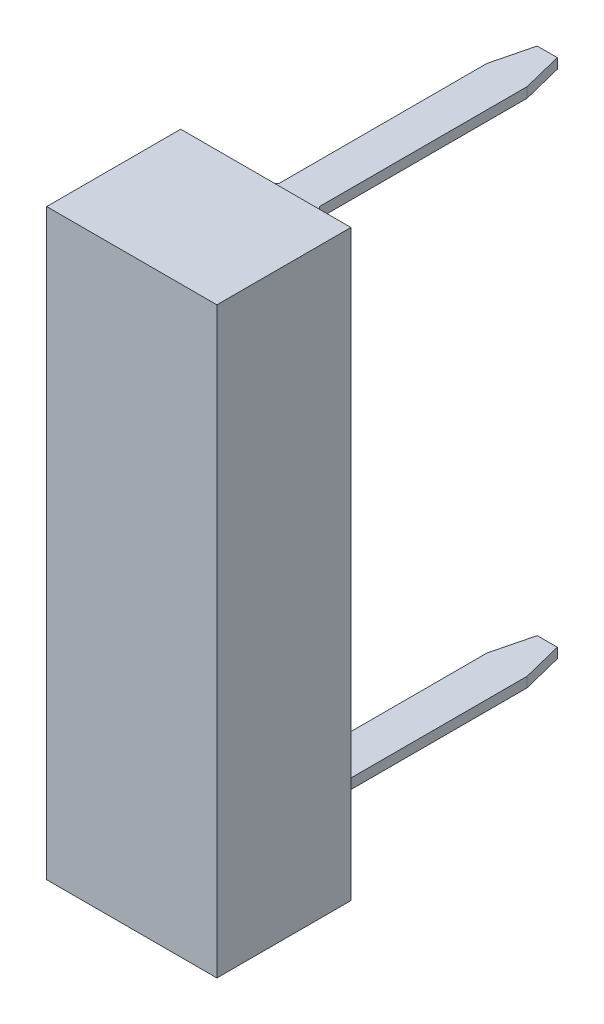
ISO-10303-21;
HEADER;
FILE_DESCRIPTION(('STEP AP214'),'2;1');
FILE_NAME('part.step','',(''),(''),'','','');
FILE_SCHEMA(('AUTOMOTIVE_DESIGN { 1 0 10303 214 1 1 1 1 }'));
ENDSEC;
DATA;
#1=APPLICATION_CONTEXT('core data for automotive mechanical design processes');
#2=APPLICATION_PROTOCOL_DEFINITION('international standard','automotive_design',2000,#1);
#3=PRODUCT_CONTEXT('',#1,'mechanical');
#4=PRODUCT('Part','Part','',(#3));
#5=PRODUCT_RELATED_PRODUCT_CATEGORY('part','',(#4));
#6=PRODUCT_DEFINITION_FORMATION('','',#4);
#7=PRODUCT_DEFINITION_CONTEXT('part definition',#1,'design');
#8=PRODUCT_DEFINITION('design','',#6,#7);
#9=PRODUCT_DEFINITION_SHAPE('','',#8);
#10=(LENGTH_UNIT() NAMED_UNIT(*) SI_UNIT(.MILLI.,.METRE.));
#11=(NAMED_UNIT(*) PLANE_ANGLE_UNIT() SI_UNIT($,.RADIAN.));
#12=(NAMED_UNIT(*) SI_UNIT($,.STERADIAN.) SOLID_ANGLE_UNIT());
#13=UNCERTAINTY_MEASURE_WITH_UNIT(LENGTH_MEASURE(1.E-05),#10,'distance_accuracy_value','');
#14=(GEOMETRIC_REPRESENTATION_CONTEXT(3) GLOBAL_UNCERTAINTY_ASSIGNED_CONTEXT((#13)) GLOBAL_UNIT_ASSIGNED_CONTEXT((#10,
#11,#12)) REPRESENTATION_CONTEXT('',''));
#15=CARTESIAN_POINT('',(0.,0.,0.));
#16=DIRECTION('',(0.,0.,1.));
#17=DIRECTION('',(1.,0.,0.));
#18=AXIS2_PLACEMENT_3D('',#15,#16,#17);
#19=CARTESIAN_POINT('',(0.6,3.885,-4.2));
#20=DIRECTION('',(0.,1.,0.));
#21=DIRECTION('',(-1.,0.,0.));
#22=AXIS2_PLACEMENT_3D('',#19,#20,#21);
#23=PLANE('',#22);
#24=DIRECTION('',(0.,0.,-1.));
#25=VECTOR('',#24,1.);
#26=CARTESIAN_POINT('',(0.3,3.885,-4.2));
#27=LINE('',#26,#25);
#28=CARTESIAN_POINT('',(0.3,3.885,-3.6));
#29=VERTEX_POINT('',#28);
#30=CARTESIAN_POINT('',(0.299999999999995,3.885,-0.499999999999995));
#31=VERTEX_POINT('',#30);
#32=EDGE_CURVE('E219',#29,#31,#27,.F.);
#33=ORIENTED_EDGE('',*,*,#32,.F.);
#34=DIRECTION('',(-0.242535625036098,0.,-0.970142500145391));
#35=VECTOR('',#34,1.);
#36=CARTESIAN_POINT('',(0.3,3.885,-3.6));
#37=LINE('',#36,#35);
#38=CARTESIAN_POINT('',(0.150000000000036,3.885,-4.20000000000001));
#39=VERTEX_POINT('',#38);
#40=EDGE_CURVE('E228',#39,#29,#37,.F.);
#41=ORIENTED_EDGE('',*,*,#40,.F.);
#42=DIRECTION('',(1.,0.,0.));
#43=VECTOR('',#42,1.);
#44=CARTESIAN_POINT('',(0.6,3.885,-4.2));
#45=LINE('',#44,#43);
#46=CARTESIAN_POINT('',(-0.150000000000036,3.885,-4.20000000000001));
#47=VERTEX_POINT('',#46);
#48=EDGE_CURVE('E235',#39,#47,#45,.F.);
#49=ORIENTED_EDGE('',*,*,#48,.T.);
#50=DIRECTION('',(-0.242535625036098,0.,0.970142500145391));
#51=VECTOR('',#50,1.);
#52=CARTESIAN_POINT('',(-0.3,3.885,-3.6));
#53=LINE('',#52,#51);
#54=CARTESIAN_POINT('',(-0.3,3.885,-3.6));
#55=VERTEX_POINT('',#54);
#56=EDGE_CURVE('E204',#55,#47,#53,.F.);
#57=ORIENTED_EDGE('',*,*,#56,.F.);
#58=DIRECTION('',(0.,0.,1.));
#59=VECTOR('',#58,1.);
#60=CARTESIAN_POINT('',(-0.3,3.885,-0.5));
#61=LINE('',#60,#59);
#62=CARTESIAN_POINT('',(-0.3,3.885,-0.5));
#63=VERTEX_POINT('',#62);
#64=EDGE_CURVE('E201',#63,#55,#61,.F.);
#65=ORIENTED_EDGE('',*,*,#64,.F.);
#66=DIRECTION('',(-0.707106781186547,0.,0.707106781186548));
#67=VECTOR('',#66,1.);
#68=CARTESIAN_POINT('',(-0.3,3.885,-0.5));
#69=LINE('',#68,#67);
#70=CARTESIAN_POINT('',(-0.6,3.885,-0.2));
#71=VERTEX_POINT('',#70);
#72=EDGE_CURVE('E20',#63,#71,#69,.T.);
#73=ORIENTED_EDGE('',*,*,#72,.T.);
#74=DIRECTION('',(0.,0.,1.));
#75=VECTOR('',#74,1.);
#76=CARTESIAN_POINT('',(-0.6,3.885,-4.2));
#77=LINE('',#76,#75);
#78=CARTESIAN_POINT('',(-0.6,3.885,0.));
#79=VERTEX_POINT('',#78);
#80=EDGE_CURVE('E182',#71,#79,#77,.T.);
#81=ORIENTED_EDGE('',*,*,#80,.T.);
#82=DIRECTION('',(-1.,0.,0.));
#83=VECTOR('',#82,1.);
#84=CARTESIAN_POINT('',(0.6,3.885,0.));
#85=LINE('',#84,#83);
#86=CARTESIAN_POINT('',(0.6,3.885,0.));
#87=VERTEX_POINT('',#86);
#88=EDGE_CURVE('E176',#79,#87,#85,.F.);
#89=ORIENTED_EDGE('',*,*,#88,.T.);
#90=DIRECTION('',(0.,0.,1.));
#91=VECTOR('',#90,1.);
#92=CARTESIAN_POINT('',(0.6,3.885,-4.2));
#93=LINE('',#92,#91);
#94=CARTESIAN_POINT('',(0.599999999999996,3.885,-0.199999999999996));
#95=VERTEX_POINT('',#94);
#96=EDGE_CURVE('E253',#87,#95,#93,.F.);
#97=ORIENTED_EDGE('',*,*,#96,.T.);
#98=DIRECTION('',(-0.707106781186547,0.,-0.707106781186548));
#99=VECTOR('',#98,1.);
#100=CARTESIAN_POINT('',(0.6,3.885,-0.2));
#101=LINE('',#100,#99);
#102=EDGE_CURVE('E251',#95,#31,#101,.T.);
#103=ORIENTED_EDGE('',*,*,#102,.T.);
#104=EDGE_LOOP('',(#33,#41,#49,#57,#65,#73,#81,#89,#97,#103));
#105=FACE_BOUND('',#104,.T.);
#106=ADVANCED_FACE('F17',(#105),#23,.T.);
#107=CARTESIAN_POINT('',(-0.6,-3.735,-4.2));
#108=DIRECTION('',(0.,-1.,0.));
#109=DIRECTION('',(0.,0.,-1.));
#110=AXIS2_PLACEMENT_3D('',#107,#108,#109);
#111=PLANE('',#110);
#112=DIRECTION('',(0.242535625036333,0.,0.970142500145332));
#113=VECTOR('',#112,1.);
#114=CARTESIAN_POINT('',(0.15,-3.735,-4.2));
#115=LINE('',#114,#113);
#116=CARTESIAN_POINT('',(0.150000000000036,-3.735,-4.20000000000001));
#117=VERTEX_POINT('',#116);
#118=CARTESIAN_POINT('',(0.3,-3.735,-3.6));
#119=VERTEX_POINT('',#118);
#120=EDGE_CURVE('E207',#117,#119,#115,.T.);
#121=ORIENTED_EDGE('',*,*,#120,.F.);
#122=DIRECTION('',(1.,0.,0.));
#123=VECTOR('',#122,1.);
#124=CARTESIAN_POINT('',(-0.6,-3.735,-4.2));
#125=LINE('',#124,#123);
#126=CARTESIAN_POINT('',(-0.150000000000036,-3.735,-4.20000000000001));
#127=VERTEX_POINT('',#126);
#128=EDGE_CURVE('E241',#127,#117,#125,.T.);
#129=ORIENTED_EDGE('',*,*,#128,.F.);
#130=DIRECTION('',(-0.242535625036098,0.,0.970142500145391));
#131=VECTOR('',#130,1.);
#132=CARTESIAN_POINT('',(-0.3,-3.735,-3.6));
#133=LINE('',#132,#131);
#134=CARTESIAN_POINT('',(-0.3,-3.735,-3.6));
#135=VERTEX_POINT('',#134);
#136=EDGE_CURVE('E213',#135,#127,#133,.F.);
#137=ORIENTED_EDGE('',*,*,#136,.F.);
#138=DIRECTION('',(0.,0.,-1.));
#139=VECTOR('',#138,1.);
#140=CARTESIAN_POINT('',(-0.3,-3.735,-0.5));
#141=LINE('',#140,#139);
#142=CARTESIAN_POINT('',(-0.299999999999993,-3.735,-0.499999999999994));
#143=VERTEX_POINT('',#142);
#144=EDGE_CURVE('E338',#135,#143,#141,.F.);
#145=ORIENTED_EDGE('',*,*,#144,.T.);
#146=DIRECTION('',(0.707106781186547,0.,-0.707106781186548));
#147=VECTOR('',#146,1.);
#148=CARTESIAN_POINT('',(-0.6,-3.735,-0.2));
#149=LINE('',#148,#147);
#150=CARTESIAN_POINT('',(-0.599999999999993,-3.735,-0.199999999999994));
#151=VERTEX_POINT('',#150);
#152=EDGE_CURVE('E243',#151,#143,#149,.T.);
#153=ORIENTED_EDGE('',*,*,#152,.F.);
#154=DIRECTION('',(0.,0.,-1.));
#155=VECTOR('',#154,1.);
#156=CARTESIAN_POINT('',(-0.6,-3.735,-4.2));
#157=LINE('',#156,#155);
#158=CARTESIAN_POINT('',(-0.6,-3.735,0.));
#159=VERTEX_POINT('',#158);
#160=EDGE_CURVE('E245',#159,#151,#157,.T.);
#161=ORIENTED_EDGE('',*,*,#160,.F.);
#162=DIRECTION('',(1.,0.,0.));
#163=VECTOR('',#162,1.);
#164=CARTESIAN_POINT('',(-0.6,-3.735,0.));
#165=LINE('',#164,#163);
#166=CARTESIAN_POINT('',(0.6,-3.735,0.));
#167=VERTEX_POINT('',#166);
#168=EDGE_CURVE('E247',#167,#159,#165,.F.);
#169=ORIENTED_EDGE('',*,*,#168,.F.);
#170=DIRECTION('',(0.,0.,-1.));
#171=VECTOR('',#170,1.);
#172=CARTESIAN_POINT('',(0.6,-3.735,-4.2));
#173=LINE('',#172,#171);
#174=CARTESIAN_POINT('',(0.6,-3.735,-0.2));
#175=VERTEX_POINT('',#174);
#176=EDGE_CURVE('E249',#175,#167,#173,.F.);
#177=ORIENTED_EDGE('',*,*,#176,.F.);
#178=DIRECTION('',(0.707106781186548,0.,0.707106781186548));
#179=VECTOR('',#178,1.);
#180=CARTESIAN_POINT('',(0.6,-3.735,-0.2));
#181=LINE('',#180,#179);
#182=CARTESIAN_POINT('',(0.3,-3.735,-0.5));
#183=VERTEX_POINT('',#182);
#184=EDGE_CURVE('E336',#175,#183,#181,.F.);
#185=ORIENTED_EDGE('',*,*,#184,.T.);
#186=DIRECTION('',(0.,0.,1.));
#187=VECTOR('',#186,1.);
#188=CARTESIAN_POINT('',(0.3,-3.735,-4.2));
#189=LINE('',#188,#187);
#190=EDGE_CURVE('E330',#183,#119,#189,.F.);
#191=ORIENTED_EDGE('',*,*,#190,.T.);
#192=EDGE_LOOP('',(#121,#129,#137,#145,#153,#161,#169,#177,#185,#191));
#193=FACE_BOUND('',#192,.T.);
#194=ADVANCED_FACE('F353',(#193),#111,.F.);
#195=CARTESIAN_POINT('',(-0.3,10.980965349185,-0.5));
#196=DIRECTION('',(-1.,0.,0.));
#197=DIRECTION('',(0.,0.,1.));
#198=AXIS2_PLACEMENT_3D('',#195,#196,#197);
#199=PLANE('',#198);
#200=DIRECTION('',(0.,0.,-1.));
#201=VECTOR('',#200,1.);
#202=CARTESIAN_POINT('',(-0.3,3.735,-4.2));
#203=LINE('',#202,#201);
#204=CARTESIAN_POINT('',(-0.3,3.735,-0.5));
#205=VERTEX_POINT('',#204);
#206=CARTESIAN_POINT('',(-0.3,3.735,-3.6));
#207=VERTEX_POINT('',#206);
#208=EDGE_CURVE('E212',#205,#207,#203,.T.);
#209=ORIENTED_EDGE('',*,*,#208,.F.);
#210=DIRECTION('',(0.,1.,0.));
#211=VECTOR('',#210,1.);
#212=CARTESIAN_POINT('',(-0.3,3.885,-0.5));
#213=LINE('',#212,#211);
#214=EDGE_CURVE('E209',#205,#63,#213,.T.);
#215=ORIENTED_EDGE('',*,*,#214,.T.);
#216=ORIENTED_EDGE('',*,*,#64,.T.);
#217=DIRECTION('',(0.,1.,0.));
#218=VECTOR('',#217,1.);
#219=CARTESIAN_POINT('',(-0.3,10.980965349185,-3.6));
#220=LINE('',#219,#218);
#221=EDGE_CURVE('E237',#207,#55,#220,.T.);
#222=ORIENTED_EDGE('',*,*,#221,.F.);
#223=EDGE_LOOP('',(#209,#215,#216,#222));
#224=FACE_BOUND('',#223,.T.);
#225=ADVANCED_FACE('F210',(#224),#199,.T.);
#226=CARTESIAN_POINT('',(-0.3,10.980965349185,-3.6));
#227=DIRECTION('',(-0.970142500145391,0.,-0.242535625036098));
#228=DIRECTION('',(-0.242535625036098,0.,0.970142500145391));
#229=AXIS2_PLACEMENT_3D('',#226,#227,#228);
#230=PLANE('',#229);
#231=DIRECTION('',(0.242535625036333,0.,-0.970142500145332));
#232=VECTOR('',#231,1.);
#233=CARTESIAN_POINT('',(-0.3,3.735,-3.6));
#234=LINE('',#233,#232);
#235=CARTESIAN_POINT('',(-0.150000000000073,3.735,-4.20000000000002));
#236=VERTEX_POINT('',#235);
#237=EDGE_CURVE('E313',#207,#236,#234,.T.);
#238=ORIENTED_EDGE('',*,*,#237,.F.);
#239=ORIENTED_EDGE('',*,*,#221,.T.);
#240=ORIENTED_EDGE('',*,*,#56,.T.);
#241=DIRECTION('',(0.,1.,0.));
#242=VECTOR('',#241,1.);
#243=CARTESIAN_POINT('',(-0.15,3.735,-4.2));
#244=LINE('',#243,#242);
#245=EDGE_CURVE('E233',#47,#236,#244,.F.);
#246=ORIENTED_EDGE('',*,*,#245,.T.);
#247=EDGE_LOOP('',(#238,#239,#240,#246));
#248=FACE_BOUND('',#247,.T.);
#249=ADVANCED_FACE('F660',(#248),#230,.T.);
#250=CARTESIAN_POINT('',(0.6,3.735,-4.2));
#251=DIRECTION('',(0.,0.,1.));
#252=DIRECTION('',(1.,0.,0.));
#253=AXIS2_PLACEMENT_3D('',#250,#251,#252);
#254=PLANE('',#253);
#255=ORIENTED_EDGE('',*,*,#245,.F.);
#256=ORIENTED_EDGE('',*,*,#48,.F.);
#257=DIRECTION('',(0.,1.,0.));
#258=VECTOR('',#257,1.);
#259=CARTESIAN_POINT('',(0.150000000000145,10.980965349185,-4.20000000000004));
#260=LINE('',#259,#258);
#261=CARTESIAN_POINT('',(0.150000000000036,3.735,-4.20000000000001));
#262=VERTEX_POINT('',#261);
#263=EDGE_CURVE('E230',#262,#39,#260,.T.);
#264=ORIENTED_EDGE('',*,*,#263,.F.);
#265=DIRECTION('',(1.,0.,0.));
#266=VECTOR('',#265,1.);
#267=CARTESIAN_POINT('',(-0.6,3.735,-4.2));
#268=LINE('',#267,#266);
#269=EDGE_CURVE('E310',#236,#262,#268,.T.);
#270=ORIENTED_EDGE('',*,*,#269,.F.);
#271=EDGE_LOOP('',(#255,#256,#264,#270));
#272=FACE_BOUND('',#271,.T.);
#273=ADVANCED_FACE('F651',(#272),#254,.F.);
#274=CARTESIAN_POINT('',(0.3,10.980965349185,-3.6));
#275=DIRECTION('',(0.970142500145391,0.,-0.242535625036098));
#276=DIRECTION('',(-0.242535625036098,0.,-0.970142500145391));
#277=AXIS2_PLACEMENT_3D('',#274,#275,#276);
#278=PLANE('',#277);
#279=ORIENTED_EDGE('',*,*,#40,.T.);
#280=DIRECTION('',(0.,1.,0.));
#281=VECTOR('',#280,1.);
#282=CARTESIAN_POINT('',(0.3,10.980965349185,-3.6));
#283=LINE('',#282,#281);
#284=CARTESIAN_POINT('',(0.3,3.735,-3.6));
#285=VERTEX_POINT('',#284);
#286=EDGE_CURVE('E225',#285,#29,#283,.T.);
#287=ORIENTED_EDGE('',*,*,#286,.F.);
#288=DIRECTION('',(0.242535625036333,0.,0.970142500145332));
#289=VECTOR('',#288,1.);
#290=CARTESIAN_POINT('',(0.15,3.735,-4.2));
#291=LINE('',#290,#289);
#292=EDGE_CURVE('E307',#262,#285,#291,.T.);
#293=ORIENTED_EDGE('',*,*,#292,.F.);
#294=ORIENTED_EDGE('',*,*,#263,.T.);
#295=EDGE_LOOP('',(#279,#287,#293,#294));
#296=FACE_BOUND('',#295,.T.);
#297=ADVANCED_FACE('F642',(#296),#278,.T.);
#298=CARTESIAN_POINT('',(0.3,10.980965349185,-4.2));
#299=DIRECTION('',(1.,0.,0.));
#300=DIRECTION('',(0.,0.,-1.));
#301=AXIS2_PLACEMENT_3D('',#298,#299,#300);
#302=PLANE('',#301);
#303=ORIENTED_EDGE('',*,*,#32,.T.);
#304=DIRECTION('',(0.,1.,0.));
#305=VECTOR('',#304,1.);
#306=CARTESIAN_POINT('',(0.3,10.980965349185,-0.5));
#307=LINE('',#306,#305);
#308=CARTESIAN_POINT('',(0.299999999999995,3.735,-0.499999999999995));
#309=VERTEX_POINT('',#308);
#310=EDGE_CURVE('E214',#31,#309,#307,.F.);
#311=ORIENTED_EDGE('',*,*,#310,.T.);
#312=DIRECTION('',(0.,0.,-1.));
#313=VECTOR('',#312,1.);
#314=CARTESIAN_POINT('',(0.3,3.735,-4.2));
#315=LINE('',#314,#313);
#316=EDGE_CURVE('E304',#285,#309,#315,.F.);
#317=ORIENTED_EDGE('',*,*,#316,.F.);
#318=ORIENTED_EDGE('',*,*,#286,.T.);
#319=EDGE_LOOP('',(#303,#311,#317,#318));
#320=FACE_BOUND('',#319,.T.);
#321=ADVANCED_FACE('F633',(#320),#302,.T.);
#322=CARTESIAN_POINT('',(0.3,10.980965349185,-0.5));
#323=DIRECTION('',(-0.707106781186548,0.,0.707106781186548));
#324=DIRECTION('',(0.707106781186548,0.,0.707106781186548));
#325=AXIS2_PLACEMENT_3D('',#322,#323,#324);
#326=PLANE('',#325);
#327=DIRECTION('',(0.,1.,0.));
#328=VECTOR('',#327,1.);
#329=CARTESIAN_POINT('',(0.6,3.735,-0.2));
#330=LINE('',#329,#328);
#331=CARTESIAN_POINT('',(0.599999999999991,3.735,-0.199999999999991));
#332=VERTEX_POINT('',#331);
#333=EDGE_CURVE('E262',#332,#95,#330,.T.);
#334=ORIENTED_EDGE('',*,*,#333,.F.);
#335=DIRECTION('',(0.707106781186547,0.,0.707106781186548));
#336=VECTOR('',#335,1.);
#337=CARTESIAN_POINT('',(0.3,3.735,-0.5));
#338=LINE('',#337,#336);
#339=EDGE_CURVE('E301',#309,#332,#338,.T.);
#340=ORIENTED_EDGE('',*,*,#339,.F.);
#341=ORIENTED_EDGE('',*,*,#310,.F.);
#342=ORIENTED_EDGE('',*,*,#102,.F.);
#343=EDGE_LOOP('',(#334,#340,#341,#342));
#344=FACE_BOUND('',#343,.T.);
#345=ADVANCED_FACE('F625',(#344),#326,.F.);
#346=CARTESIAN_POINT('',(-0.6,3.885,-0.2));
#347=DIRECTION('',(0.707106781186548,0.,0.707106781186548));
#348=DIRECTION('',(0.707106781186548,0.,-0.707106781186548));
#349=AXIS2_PLACEMENT_3D('',#346,#347,#348);
#350=PLANE('',#349);
#351=ORIENTED_EDGE('',*,*,#214,.F.);
#352=DIRECTION('',(0.707106781186547,0.,-0.707106781186548));
#353=VECTOR('',#352,1.);
#354=CARTESIAN_POINT('',(-0.6,3.735,-0.2));
#355=LINE('',#354,#353);
#356=CARTESIAN_POINT('',(-0.599999999999999,3.735,-0.2));
#357=VERTEX_POINT('',#356);
#358=EDGE_CURVE('E195',#357,#205,#355,.T.);
#359=ORIENTED_EDGE('',*,*,#358,.F.);
#360=DIRECTION('',(0.,-1.,0.));
#361=VECTOR('',#360,1.);
#362=CARTESIAN_POINT('',(-0.6,3.885,-0.2));
#363=LINE('',#362,#361);
#364=EDGE_CURVE('E186',#71,#357,#363,.T.);
#365=ORIENTED_EDGE('',*,*,#364,.F.);
#366=ORIENTED_EDGE('',*,*,#72,.F.);
#367=EDGE_LOOP('',(#351,#359,#365,#366));
#368=FACE_BOUND('',#367,.T.);
#369=ADVANCED_FACE('F192',(#368),#350,.F.);
#370=CARTESIAN_POINT('',(-0.3,-10.98096534918,-3.6));
#371=DIRECTION('',(-0.970142500145391,0.,-0.242535625036098));
#372=DIRECTION('',(-0.242535625036098,0.,0.970142500145391));
#373=AXIS2_PLACEMENT_3D('',#370,#371,#372);
#374=PLANE('',#373);
#375=DIRECTION('',(-0.242535625036333,0.,0.970142500145332));
#376=VECTOR('',#375,1.);
#377=CARTESIAN_POINT('',(-0.15,-3.885,-4.2));
#378=LINE('',#377,#376);
#379=CARTESIAN_POINT('',(-0.150000000000073,-3.885,-4.20000000000002));
#380=VERTEX_POINT('',#379);
#381=CARTESIAN_POINT('',(-0.3,-3.885,-3.6));
#382=VERTEX_POINT('',#381);
#383=EDGE_CURVE('E293',#380,#382,#378,.T.);
#384=ORIENTED_EDGE('',*,*,#383,.T.);
#385=DIRECTION('',(0.,1.,0.));
#386=VECTOR('',#385,1.);
#387=CARTESIAN_POINT('',(-0.3,-10.98096534918,-3.6));
#388=LINE('',#387,#386);
#389=EDGE_CURVE('E217',#382,#135,#388,.T.);
#390=ORIENTED_EDGE('',*,*,#389,.T.);
#391=ORIENTED_EDGE('',*,*,#136,.T.);
#392=DIRECTION('',(0.,1.,0.));
#393=VECTOR('',#392,1.);
#394=CARTESIAN_POINT('',(-0.15,-3.735,-4.2));
#395=LINE('',#394,#393);
#396=EDGE_CURVE('E321',#380,#127,#395,.T.);
#397=ORIENTED_EDGE('',*,*,#396,.F.);
#398=EDGE_LOOP('',(#384,#390,#391,#397));
#399=FACE_BOUND('',#398,.T.);
#400=ADVANCED_FACE('F344',(#399),#374,.T.);
#401=CARTESIAN_POINT('',(-0.3,-10.98096534918,-0.5));
#402=DIRECTION('',(1.,0.,0.));
#403=DIRECTION('',(0.,0.,-1.));
#404=AXIS2_PLACEMENT_3D('',#401,#402,#403);
#405=PLANE('',#404);
#406=ORIENTED_EDGE('',*,*,#389,.F.);
#407=DIRECTION('',(0.,0.,1.));
#408=VECTOR('',#407,1.);
#409=CARTESIAN_POINT('',(-0.3,-3.885,-4.2));
#410=LINE('',#409,#408);
#411=CARTESIAN_POINT('',(-0.299999999999994,-3.885,-0.499999999999993));
#412=VERTEX_POINT('',#411);
#413=EDGE_CURVE('E291',#382,#412,#410,.T.);
#414=ORIENTED_EDGE('',*,*,#413,.T.);
#415=DIRECTION('',(0.,1.,0.));
#416=VECTOR('',#415,1.);
#417=CARTESIAN_POINT('',(-0.3,-10.98096534918,-0.5));
#418=LINE('',#417,#416);
#419=EDGE_CURVE('E318',#412,#143,#418,.T.);
#420=ORIENTED_EDGE('',*,*,#419,.T.);
#421=ORIENTED_EDGE('',*,*,#144,.F.);
#422=EDGE_LOOP('',(#406,#414,#420,#421));
#423=FACE_BOUND('',#422,.T.);
#424=ADVANCED_FACE('F348',(#423),#405,.F.);
#425=CARTESIAN_POINT('',(0.6,-3.735,-0.2));
#426=DIRECTION('',(-0.707106781186548,0.,0.707106781186548));
#427=DIRECTION('',(0.707106781186548,0.,0.707106781186548));
#428=AXIS2_PLACEMENT_3D('',#425,#426,#427);
#429=PLANE('',#428);
#430=DIRECTION('',(0.,1.,0.));
#431=VECTOR('',#430,1.);
#432=CARTESIAN_POINT('',(0.3,-10.98096534918,-0.5));
#433=LINE('',#432,#431);
#434=CARTESIAN_POINT('',(0.3,-3.885,-0.5));
#435=VERTEX_POINT('',#434);
#436=EDGE_CURVE('E333',#435,#183,#433,.T.);
#437=ORIENTED_EDGE('',*,*,#436,.T.);
#438=ORIENTED_EDGE('',*,*,#184,.F.);
#439=DIRECTION('',(0.,-1.,0.));
#440=VECTOR('',#439,1.);
#441=CARTESIAN_POINT('',(0.6,-3.735,-0.2));
#442=LINE('',#441,#440);
#443=CARTESIAN_POINT('',(0.600000000000001,-3.885,-0.2));
#444=VERTEX_POINT('',#443);
#445=EDGE_CURVE('E295',#175,#444,#442,.T.);
#446=ORIENTED_EDGE('',*,*,#445,.T.);
#447=DIRECTION('',(-0.707106781186547,0.,-0.707106781186548));
#448=VECTOR('',#447,1.);
#449=CARTESIAN_POINT('',(0.6,-3.885,-0.2));
#450=LINE('',#449,#448);
#451=EDGE_CURVE('E284',#444,#435,#450,.T.);
#452=ORIENTED_EDGE('',*,*,#451,.T.);
#453=EDGE_LOOP('',(#437,#438,#446,#452));
#454=FACE_BOUND('',#453,.T.);
#455=ADVANCED_FACE('F594',(#454),#429,.F.);
#456=CARTESIAN_POINT('',(0.3,-10.98096534918,-4.2));
#457=DIRECTION('',(-1.,0.,0.));
#458=DIRECTION('',(0.,0.,1.));
#459=AXIS2_PLACEMENT_3D('',#456,#457,#458);
#460=PLANE('',#459);
#461=DIRECTION('',(0.,1.,0.));
#462=VECTOR('',#461,1.);
#463=CARTESIAN_POINT('',(0.3,-10.98096534918,-3.6));
#464=LINE('',#463,#462);
#465=CARTESIAN_POINT('',(0.3,-3.885,-3.6));
#466=VERTEX_POINT('',#465);
#467=EDGE_CURVE('E327',#119,#466,#464,.F.);
#468=ORIENTED_EDGE('',*,*,#467,.F.);
#469=ORIENTED_EDGE('',*,*,#190,.F.);
#470=ORIENTED_EDGE('',*,*,#436,.F.);
#471=DIRECTION('',(0.,0.,1.));
#472=VECTOR('',#471,1.);
#473=CARTESIAN_POINT('',(0.3,-3.885,-4.2));
#474=LINE('',#473,#472);
#475=EDGE_CURVE('E282',#435,#466,#474,.F.);
#476=ORIENTED_EDGE('',*,*,#475,.T.);
#477=EDGE_LOOP('',(#468,#469,#470,#476));
#478=FACE_BOUND('',#477,.T.);
#479=ADVANCED_FACE('F586',(#478),#460,.F.);
#480=CARTESIAN_POINT('',(0.3,-10.98096534918,-3.6));
#481=DIRECTION('',(0.970142500145391,0.,-0.242535625036098));
#482=DIRECTION('',(-0.242535625036098,0.,-0.970142500145391));
#483=AXIS2_PLACEMENT_3D('',#480,#481,#482);
#484=PLANE('',#483);
#485=ORIENTED_EDGE('',*,*,#120,.T.);
#486=ORIENTED_EDGE('',*,*,#467,.T.);
#487=DIRECTION('',(-0.242535625036333,0.,-0.970142500145332));
#488=VECTOR('',#487,1.);
#489=CARTESIAN_POINT('',(0.3,-3.885,-3.6));
#490=LINE('',#489,#488);
#491=CARTESIAN_POINT('',(0.150000000000073,-3.885,-4.20000000000002));
#492=VERTEX_POINT('',#491);
#493=EDGE_CURVE('E280',#466,#492,#490,.T.);
#494=ORIENTED_EDGE('',*,*,#493,.T.);
#495=DIRECTION('',(0.,1.,0.));
#496=VECTOR('',#495,1.);
#497=CARTESIAN_POINT('',(0.15,-3.735,-4.2));
#498=LINE('',#497,#496);
#499=EDGE_CURVE('E324',#117,#492,#498,.F.);
#500=ORIENTED_EDGE('',*,*,#499,.F.);
#501=EDGE_LOOP('',(#485,#486,#494,#500));
#502=FACE_BOUND('',#501,.T.);
#503=ADVANCED_FACE('F360',(#502),#484,.T.);
#504=CARTESIAN_POINT('',(-0.6,-3.735,-4.2));
#505=DIRECTION('',(0.,0.,-1.));
#506=DIRECTION('',(-1.,0.,0.));
#507=AXIS2_PLACEMENT_3D('',#504,#505,#506);
#508=PLANE('',#507);
#509=DIRECTION('',(1.,0.,0.));
#510=VECTOR('',#509,1.);
#511=CARTESIAN_POINT('',(0.6,-3.885,-4.2));
#512=LINE('',#511,#510);
#513=EDGE_CURVE('E277',#492,#380,#512,.F.);
#514=ORIENTED_EDGE('',*,*,#513,.T.);
#515=ORIENTED_EDGE('',*,*,#396,.T.);
#516=ORIENTED_EDGE('',*,*,#128,.T.);
#517=ORIENTED_EDGE('',*,*,#499,.T.);
#518=EDGE_LOOP('',(#514,#515,#516,#517));
#519=FACE_BOUND('',#518,.T.);
#520=ADVANCED_FACE('F357',(#519),#508,.T.);
#521=CARTESIAN_POINT('',(-0.3,-10.98096534918,-0.5));
#522=DIRECTION('',(0.707106781186548,0.,0.707106781186548));
#523=DIRECTION('',(0.707106781186548,0.,-0.707106781186548));
#524=AXIS2_PLACEMENT_3D('',#521,#522,#523);
#525=PLANE('',#524);
#526=DIRECTION('',(0.,1.,0.));
#527=VECTOR('',#526,1.);
#528=CARTESIAN_POINT('',(-0.6,-3.885,-0.2));
#529=LINE('',#528,#527);
#530=CARTESIAN_POINT('',(-0.599999999999994,-3.885,-0.199999999999993));
#531=VERTEX_POINT('',#530);
#532=EDGE_CURVE('E267',#531,#151,#529,.T.);
#533=ORIENTED_EDGE('',*,*,#532,.T.);
#534=ORIENTED_EDGE('',*,*,#152,.T.);
#535=ORIENTED_EDGE('',*,*,#419,.F.);
#536=DIRECTION('',(-0.707106781186547,0.,0.707106781186548));
#537=VECTOR('',#536,1.);
#538=CARTESIAN_POINT('',(-0.3,-3.885,-0.5));
#539=LINE('',#538,#537);
#540=EDGE_CURVE('E289',#412,#531,#539,.T.);
#541=ORIENTED_EDGE('',*,*,#540,.T.);
#542=EDGE_LOOP('',(#533,#534,#535,#541));
#543=FACE_BOUND('',#542,.T.);
#544=ADVANCED_FACE('F369',(#543),#525,.F.);
#545=CARTESIAN_POINT('',(0.6,3.735,-4.2));
#546=DIRECTION('',(1.,0.,0.));
#547=DIRECTION('',(0.,1.,0.));
#548=AXIS2_PLACEMENT_3D('',#545,#546,#547);
#549=PLANE('',#548);
#550=ORIENTED_EDGE('',*,*,#96,.F.);
#551=DIRECTION('',(0.,1.,0.));
#552=VECTOR('',#551,1.);
#553=CARTESIAN_POINT('',(0.6,-4.35,0.));
#554=LINE('',#553,#552);
#555=CARTESIAN_POINT('',(0.6,3.735,0.));
#556=VERTEX_POINT('',#555);
#557=EDGE_CURVE('E260',#87,#556,#554,.F.);
#558=ORIENTED_EDGE('',*,*,#557,.T.);
#559=DIRECTION('',(0.,0.,-1.));
#560=VECTOR('',#559,1.);
#561=CARTESIAN_POINT('',(0.6,3.735,-4.2));
#562=LINE('',#561,#560);
#563=EDGE_CURVE('E299',#332,#556,#562,.F.);
#564=ORIENTED_EDGE('',*,*,#563,.F.);
#565=ORIENTED_EDGE('',*,*,#333,.T.);
#566=EDGE_LOOP('',(#550,#558,#564,#565));
#567=FACE_BOUND('',#566,.T.);
#568=ADVANCED_FACE('F258',(#567),#549,.T.);
#569=CARTESIAN_POINT('',(-0.6,3.735,-4.2));
#570=DIRECTION('',(0.,-1.,0.));
#571=DIRECTION('',(0.,0.,-1.));
#572=AXIS2_PLACEMENT_3D('',#569,#570,#571);
#573=PLANE('',#572);
#574=DIRECTION('',(0.,0.,1.));
#575=VECTOR('',#574,1.);
#576=CARTESIAN_POINT('',(-0.599999999999999,3.735,-4.2));
#577=LINE('',#576,#575);
#578=CARTESIAN_POINT('',(-0.6,3.735,0.));
#579=VERTEX_POINT('',#578);
#580=EDGE_CURVE('E197',#357,#579,#577,.T.);
#581=ORIENTED_EDGE('',*,*,#580,.F.);
#582=ORIENTED_EDGE('',*,*,#358,.T.);
#583=ORIENTED_EDGE('',*,*,#208,.T.);
#584=ORIENTED_EDGE('',*,*,#237,.T.);
#585=ORIENTED_EDGE('',*,*,#269,.T.);
#586=ORIENTED_EDGE('',*,*,#292,.T.);
#587=ORIENTED_EDGE('',*,*,#316,.T.);
#588=ORIENTED_EDGE('',*,*,#339,.T.);
#589=ORIENTED_EDGE('',*,*,#563,.T.);
#590=DIRECTION('',(1.,0.,0.));
#591=VECTOR('',#590,1.);
#592=CARTESIAN_POINT('',(-1.27,3.735,0.));
#593=LINE('',#592,#591);
#594=EDGE_CURVE('E266',#556,#579,#593,.F.);
#595=ORIENTED_EDGE('',*,*,#594,.T.);
#596=EDGE_LOOP('',(#581,#582,#583,#584,#585,#586,#587,#588,#589,#595));
#597=FACE_BOUND('',#596,.T.);
#598=ADVANCED_FACE('F549',(#597),#573,.T.);
#599=CARTESIAN_POINT('',(-0.6,3.885,-4.2));
#600=DIRECTION('',(-1.,0.,0.));
#601=DIRECTION('',(0.,-1.,0.));
#602=AXIS2_PLACEMENT_3D('',#599,#600,#601);
#603=PLANE('',#602);
#604=ORIENTED_EDGE('',*,*,#580,.T.);
#605=DIRECTION('',(0.,1.,0.));
#606=VECTOR('',#605,1.);
#607=CARTESIAN_POINT('',(-0.6,-4.35,0.));
#608=LINE('',#607,#606);
#609=EDGE_CURVE('E187',#579,#79,#608,.T.);
#610=ORIENTED_EDGE('',*,*,#609,.T.);
#611=ORIENTED_EDGE('',*,*,#80,.F.);
#612=ORIENTED_EDGE('',*,*,#364,.T.);
#613=EDGE_LOOP('',(#604,#610,#611,#612));
#614=FACE_BOUND('',#613,.T.);
#615=ADVANCED_FACE('F185',(#614),#603,.T.);
#616=CARTESIAN_POINT('',(0.6,-3.735,-4.2));
#617=DIRECTION('',(-1.,0.,0.));
#618=DIRECTION('',(0.,-1.,0.));
#619=AXIS2_PLACEMENT_3D('',#616,#617,#618);
#620=PLANE('',#619);
#621=ORIENTED_EDGE('',*,*,#445,.F.);
#622=ORIENTED_EDGE('',*,*,#176,.T.);
#623=DIRECTION('',(0.,1.,0.));
#624=VECTOR('',#623,1.);
#625=CARTESIAN_POINT('',(0.6,-4.35,0.));
#626=LINE('',#625,#624);
#627=CARTESIAN_POINT('',(0.600000000000001,-3.885,0.));
#628=VERTEX_POINT('',#627);
#629=EDGE_CURVE('E382',#167,#628,#626,.F.);
#630=ORIENTED_EDGE('',*,*,#629,.T.);
#631=DIRECTION('',(0.,0.,1.));
#632=VECTOR('',#631,1.);
#633=CARTESIAN_POINT('',(0.6,-3.885,-4.2));
#634=LINE('',#633,#632);
#635=EDGE_CURVE('E286',#628,#444,#634,.F.);
#636=ORIENTED_EDGE('',*,*,#635,.T.);
#637=EDGE_LOOP('',(#621,#622,#630,#636));
#638=FACE_BOUND('',#637,.T.);
#639=ADVANCED_FACE('F534',(#638),#620,.F.);
#640=CARTESIAN_POINT('',(0.6,-3.885,-4.2));
#641=DIRECTION('',(0.,1.,0.));
#642=DIRECTION('',(0.,0.,1.));
#643=AXIS2_PLACEMENT_3D('',#640,#641,#642);
#644=PLANE('',#643);
#645=ORIENTED_EDGE('',*,*,#493,.F.);
#646=ORIENTED_EDGE('',*,*,#475,.F.);
#647=ORIENTED_EDGE('',*,*,#451,.F.);
#648=ORIENTED_EDGE('',*,*,#635,.F.);
#649=DIRECTION('',(1.,0.,0.));
#650=VECTOR('',#649,1.);
#651=CARTESIAN_POINT('',(-1.27,-3.885,0.));
#652=LINE('',#651,#650);
#653=CARTESIAN_POINT('',(-0.6,-3.885,0.));
#654=VERTEX_POINT('',#653);
#655=EDGE_CURVE('E383',#628,#654,#652,.F.);
#656=ORIENTED_EDGE('',*,*,#655,.T.);
#657=DIRECTION('',(0.,0.,1.));
#658=VECTOR('',#657,1.);
#659=CARTESIAN_POINT('',(-0.6,-3.885,-4.2));
#660=LINE('',#659,#658);
#661=EDGE_CURVE('E271',#654,#531,#660,.F.);
#662=ORIENTED_EDGE('',*,*,#661,.T.);
#663=ORIENTED_EDGE('',*,*,#540,.F.);
#664=ORIENTED_EDGE('',*,*,#413,.F.);
#665=ORIENTED_EDGE('',*,*,#383,.F.);
#666=ORIENTED_EDGE('',*,*,#513,.F.);
#667=EDGE_LOOP('',(#645,#646,#647,#648,#656,#662,#663,#664,#665,#666));
#668=FACE_BOUND('',#667,.T.);
#669=ADVANCED_FACE('F365',(#668),#644,.F.);
#670=CARTESIAN_POINT('',(-0.6,-3.885,-4.2));
#671=DIRECTION('',(1.,0.,0.));
#672=DIRECTION('',(0.,1.,0.));
#673=AXIS2_PLACEMENT_3D('',#670,#671,#672);
#674=PLANE('',#673);
#675=ORIENTED_EDGE('',*,*,#532,.F.);
#676=ORIENTED_EDGE('',*,*,#661,.F.);
#677=DIRECTION('',(0.,1.,0.));
#678=VECTOR('',#677,1.);
#679=CARTESIAN_POINT('',(-0.6,-4.35,0.));
#680=LINE('',#679,#678);
#681=EDGE_CURVE('E376',#654,#159,#680,.T.);
#682=ORIENTED_EDGE('',*,*,#681,.T.);
#683=ORIENTED_EDGE('',*,*,#160,.T.);
#684=EDGE_LOOP('',(#675,#676,#682,#683));
#685=FACE_BOUND('',#684,.T.);
#686=ADVANCED_FACE('F373',(#685),#674,.F.);
#687=CARTESIAN_POINT('',(-1.27,-4.35,0.));
#688=DIRECTION('',(0.,0.,1.));
#689=DIRECTION('',(1.,0.,0.));
#690=AXIS2_PLACEMENT_3D('',#687,#688,#689);
#691=PLANE('',#690);
#692=ORIENTED_EDGE('',*,*,#655,.F.);
#693=ORIENTED_EDGE('',*,*,#629,.F.);
#694=ORIENTED_EDGE('',*,*,#168,.T.);
#695=ORIENTED_EDGE('',*,*,#681,.F.);
#696=EDGE_LOOP('',(#692,#693,#694,#695));
#697=FACE_BOUND('',#696,.T.);
#698=ORIENTED_EDGE('',*,*,#594,.F.);
#699=ORIENTED_EDGE('',*,*,#557,.F.);
#700=ORIENTED_EDGE('',*,*,#88,.F.);
#701=ORIENTED_EDGE('',*,*,#609,.F.);
#702=EDGE_LOOP('',(#698,#699,#700,#701));
#703=FACE_BOUND('',#702,.T.);
#704=DIRECTION('',(1.,0.,0.));
#705=VECTOR('',#704,1.);
#706=CARTESIAN_POINT('',(1.27,4.35,0.));
#707=LINE('',#706,#705);
#708=CARTESIAN_POINT('',(-1.27,4.35,0.));
#709=VERTEX_POINT('',#708);
#710=CARTESIAN_POINT('',(1.27,4.35,0.));
#711=VERTEX_POINT('',#710);
#712=EDGE_CURVE('E406',#709,#711,#707,.T.);
#713=ORIENTED_EDGE('',*,*,#712,.T.);
#714=DIRECTION('',(0.,1.,0.));
#715=VECTOR('',#714,1.);
#716=CARTESIAN_POINT('',(1.27,-4.35,0.));
#717=LINE('',#716,#715);
#718=CARTESIAN_POINT('',(1.27,-4.35,0.));
#719=VERTEX_POINT('',#718);
#720=EDGE_CURVE('E399',#711,#719,#717,.F.);
#721=ORIENTED_EDGE('',*,*,#720,.T.);
#722=DIRECTION('',(1.,0.,0.));
#723=VECTOR('',#722,1.);
#724=CARTESIAN_POINT('',(-1.27,-4.35,0.));
#725=LINE('',#724,#723);
#726=CARTESIAN_POINT('',(-1.27,-4.35,0.));
#727=VERTEX_POINT('',#726);
#728=EDGE_CURVE('E394',#719,#727,#725,.F.);
#729=ORIENTED_EDGE('',*,*,#728,.T.);
#730=DIRECTION('',(0.,1.,0.));
#731=VECTOR('',#730,1.);
#732=CARTESIAN_POINT('',(-1.27,4.35,0.));
#733=LINE('',#732,#731);
#734=EDGE_CURVE('E390',#727,#709,#733,.T.);
#735=ORIENTED_EDGE('',*,*,#734,.T.);
#736=EDGE_LOOP('',(#713,#721,#729,#735));
#737=FACE_BOUND('',#736,.T.);
#738=ADVANCED_FACE('F264',(#697,#703,#737),#691,.F.);
#739=CARTESIAN_POINT('',(-1.27,4.35,2.));
#740=DIRECTION('',(1.,0.,0.));
#741=DIRECTION('',(0.,0.,-1.));
#742=AXIS2_PLACEMENT_3D('',#739,#740,#741);
#743=PLANE('',#742);
#744=DIRECTION('',(0.,0.,1.));
#745=VECTOR('',#744,1.);
#746=CARTESIAN_POINT('',(-1.27,-4.35,2.));
#747=LINE('',#746,#745);
#748=CARTESIAN_POINT('',(-1.27,-4.35,2.));
#749=VERTEX_POINT('',#748);
#750=EDGE_CURVE('E392',#727,#749,#747,.T.);
#751=ORIENTED_EDGE('',*,*,#750,.T.);
#752=DIRECTION('',(0.,1.,0.));
#753=VECTOR('',#752,1.);
#754=CARTESIAN_POINT('',(-1.27,-4.35,2.));
#755=LINE('',#754,#753);
#756=CARTESIAN_POINT('',(-1.27,4.35,2.));
#757=VERTEX_POINT('',#756);
#758=EDGE_CURVE('E409',#757,#749,#755,.F.);
#759=ORIENTED_EDGE('',*,*,#758,.F.);
#760=DIRECTION('',(0.,0.,-1.));
#761=VECTOR('',#760,1.);
#762=CARTESIAN_POINT('',(-1.27,4.35,2.));
#763=LINE('',#762,#761);
#764=EDGE_CURVE('E403',#757,#709,#763,.T.);
#765=ORIENTED_EDGE('',*,*,#764,.T.);
#766=ORIENTED_EDGE('',*,*,#734,.F.);
#767=EDGE_LOOP('',(#751,#759,#765,#766));
#768=FACE_BOUND('',#767,.T.);
#769=ADVANCED_FACE('F429',(#768),#743,.F.);
#770=CARTESIAN_POINT('',(-1.27,-4.35,2.));
#771=DIRECTION('',(0.,1.,0.));
#772=DIRECTION('',(0.,0.,1.));
#773=AXIS2_PLACEMENT_3D('',#770,#771,#772);
#774=PLANE('',#773);
#775=DIRECTION('',(0.,0.,1.));
#776=VECTOR('',#775,1.);
#777=CARTESIAN_POINT('',(1.27,-4.35,2.));
#778=LINE('',#777,#776);
#779=CARTESIAN_POINT('',(1.27,-4.35,2.));
#780=VERTEX_POINT('',#779);
#781=EDGE_CURVE('E397',#719,#780,#778,.T.);
#782=ORIENTED_EDGE('',*,*,#781,.T.);
#783=DIRECTION('',(1.,0.,0.));
#784=VECTOR('',#783,1.);
#785=CARTESIAN_POINT('',(-1.27,-4.35,2.));
#786=LINE('',#785,#784);
#787=EDGE_CURVE('E412',#749,#780,#786,.T.);
#788=ORIENTED_EDGE('',*,*,#787,.F.);
#789=ORIENTED_EDGE('',*,*,#750,.F.);
#790=ORIENTED_EDGE('',*,*,#728,.F.);
#791=EDGE_LOOP('',(#782,#788,#789,#790));
#792=FACE_BOUND('',#791,.T.);
#793=ADVANCED_FACE('F422',(#792),#774,.F.);
#794=CARTESIAN_POINT('',(1.27,-4.35,2.));
#795=DIRECTION('',(-1.,0.,0.));
#796=DIRECTION('',(0.,0.,1.));
#797=AXIS2_PLACEMENT_3D('',#794,#795,#796);
#798=PLANE('',#797);
#799=DIRECTION('',(0.,0.,-1.));
#800=VECTOR('',#799,1.);
#801=CARTESIAN_POINT('',(1.27,4.35,2.));
#802=LINE('',#801,#800);
#803=CARTESIAN_POINT('',(1.27,4.35,2.));
#804=VERTEX_POINT('',#803);
#805=EDGE_CURVE('E35',#711,#804,#802,.F.);
#806=ORIENTED_EDGE('',*,*,#805,.T.);
#807=DIRECTION('',(0.,1.,0.));
#808=VECTOR('',#807,1.);
#809=CARTESIAN_POINT('',(1.27,-4.35,2.));
#810=LINE('',#809,#808);
#811=EDGE_CURVE('E26',#780,#804,#810,.T.);
#812=ORIENTED_EDGE('',*,*,#811,.F.);
#813=ORIENTED_EDGE('',*,*,#781,.F.);
#814=ORIENTED_EDGE('',*,*,#720,.F.);
#815=EDGE_LOOP('',(#806,#812,#813,#814));
#816=FACE_BOUND('',#815,.T.);
#817=ADVANCED_FACE('F420',(#816),#798,.F.);
#818=CARTESIAN_POINT('',(1.27,4.35,2.));
#819=DIRECTION('',(0.,-1.,0.));
#820=DIRECTION('',(0.,0.,-1.));
#821=AXIS2_PLACEMENT_3D('',#818,#819,#820);
#822=PLANE('',#821);
#823=ORIENTED_EDGE('',*,*,#764,.F.);
#824=DIRECTION('',(1.,0.,0.));
#825=VECTOR('',#824,1.);
#826=CARTESIAN_POINT('',(-1.27,4.35,2.));
#827=LINE('',#826,#825);
#828=EDGE_CURVE('E11',#804,#757,#827,.F.);
#829=ORIENTED_EDGE('',*,*,#828,.F.);
#830=ORIENTED_EDGE('',*,*,#805,.F.);
#831=ORIENTED_EDGE('',*,*,#712,.F.);
#832=EDGE_LOOP('',(#823,#829,#830,#831));
#833=FACE_BOUND('',#832,.T.);
#834=ADVANCED_FACE('F427',(#833),#822,.F.);
#835=CARTESIAN_POINT('',(-1.27,-4.35,2.));
#836=DIRECTION('',(0.,0.,1.));
#837=DIRECTION('',(1.,0.,0.));
#838=AXIS2_PLACEMENT_3D('',#835,#836,#837);
#839=PLANE('',#838);
#840=ORIENTED_EDGE('',*,*,#811,.T.);
#841=ORIENTED_EDGE('',*,*,#828,.T.);
#842=ORIENTED_EDGE('',*,*,#758,.T.);
#843=ORIENTED_EDGE('',*,*,#787,.T.);
#844=EDGE_LOOP('',(#840,#841,#842,#843));
#845=FACE_BOUND('',#844,.T.);
#846=ADVANCED_FACE('F417',(#845),#839,.T.);
#847=CLOSED_SHELL('',(#106,#194,#225,#249,#273,#297,#321,#345,#369,#400,#424,#455,#479,#503,
#520,#544,#568,#598,#615,#639,#669,#686,#738,#769,#793,#817,#834,#846));
#848=MANIFOLD_SOLID_BREP('B1',#847);
#849=ADVANCED_BREP_SHAPE_REPRESENTATION('',(#18,#848),#14);
#850=SHAPE_DEFINITION_REPRESENTATION(#9,#849);
ENDSEC;
END-ISO-10303-21;
